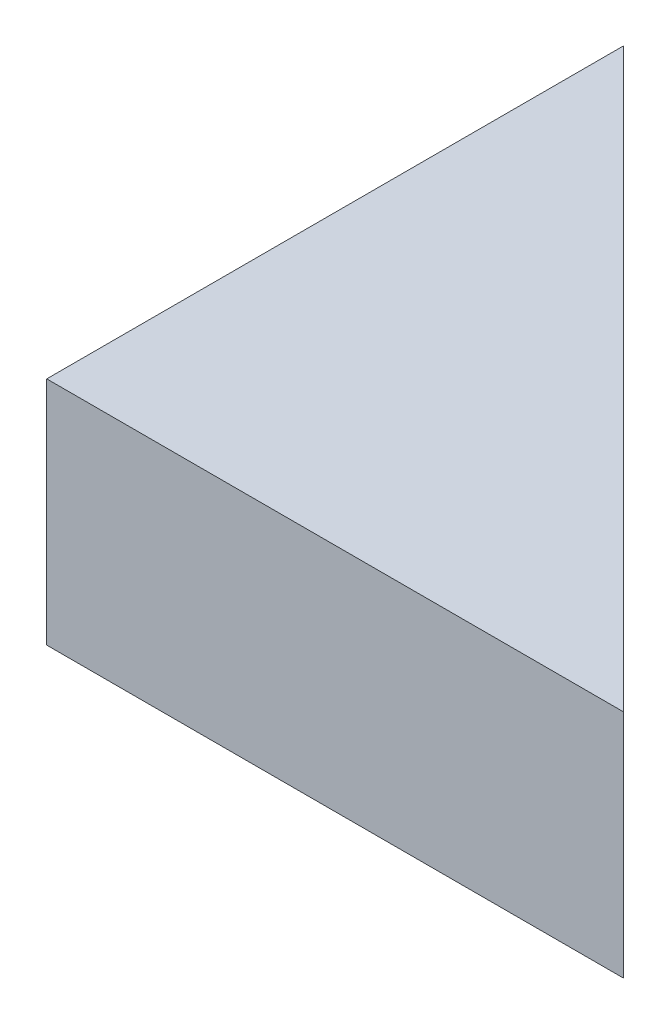
ISO-10303-21;
HEADER;
FILE_DESCRIPTION(('STEP AP214'),'2;1');
FILE_NAME('part.step','',(''),(''),'','','');
FILE_SCHEMA(('AUTOMOTIVE_DESIGN { 1 0 10303 214 1 1 1 1 }'));
ENDSEC;
DATA;
#1=APPLICATION_CONTEXT('core data for automotive mechanical design processes');
#2=APPLICATION_PROTOCOL_DEFINITION('international standard','automotive_design',2000,#1);
#3=PRODUCT_CONTEXT('',#1,'mechanical');
#4=PRODUCT('Part','Part','',(#3));
#5=PRODUCT_RELATED_PRODUCT_CATEGORY('part','',(#4));
#6=PRODUCT_DEFINITION_FORMATION('','',#4);
#7=PRODUCT_DEFINITION_CONTEXT('part definition',#1,'design');
#8=PRODUCT_DEFINITION('design','',#6,#7);
#9=PRODUCT_DEFINITION_SHAPE('','',#8);
#10=(LENGTH_UNIT() NAMED_UNIT(*) SI_UNIT(.MILLI.,.METRE.));
#11=(NAMED_UNIT(*) PLANE_ANGLE_UNIT() SI_UNIT($,.RADIAN.));
#12=(NAMED_UNIT(*) SI_UNIT($,.STERADIAN.) SOLID_ANGLE_UNIT());
#13=UNCERTAINTY_MEASURE_WITH_UNIT(LENGTH_MEASURE(1.E-05),#10,'distance_accuracy_value','');
#14=(GEOMETRIC_REPRESENTATION_CONTEXT(3) GLOBAL_UNCERTAINTY_ASSIGNED_CONTEXT((#13)) GLOBAL_UNIT_ASSIGNED_CONTEXT((#10,
#11,#12)) REPRESENTATION_CONTEXT('',''));
#15=CARTESIAN_POINT('',(0.,0.,0.));
#16=DIRECTION('',(0.,0.,1.));
#17=DIRECTION('',(1.,0.,0.));
#18=AXIS2_PLACEMENT_3D('',#15,#16,#17);
#19=CARTESIAN_POINT('',(500.,200.,0.));
#20=DIRECTION('',(0.,0.,-1.));
#21=DIRECTION('',(-1.,0.,0.));
#22=AXIS2_PLACEMENT_3D('',#19,#20,#21);
#23=PLANE('',#22);
#24=DIRECTION('',(1.,0.,0.));
#25=VECTOR('',#24,1.);
#26=CARTESIAN_POINT('',(500.,0.,0.));
#27=LINE('',#26,#25);
#28=CARTESIAN_POINT('',(0.,0.,0.));
#29=VERTEX_POINT('',#28);
#30=CARTESIAN_POINT('',(500.,0.,0.));
#31=VERTEX_POINT('',#30);
#32=EDGE_CURVE('E89',#29,#31,#27,.T.);
#33=ORIENTED_EDGE('',*,*,#32,.T.);
#34=DIRECTION('',(0.,-1.,0.));
#35=VECTOR('',#34,1.);
#36=CARTESIAN_POINT('',(500.,200.,0.));
#37=LINE('',#36,#35);
#38=CARTESIAN_POINT('',(500.,200.,0.));
#39=VERTEX_POINT('',#38);
#40=EDGE_CURVE('E11',#39,#31,#37,.T.);
#41=ORIENTED_EDGE('',*,*,#40,.F.);
#42=DIRECTION('',(1.,0.,0.));
#43=VECTOR('',#42,1.);
#44=CARTESIAN_POINT('',(500.,200.,0.));
#45=LINE('',#44,#43);
#46=CARTESIAN_POINT('',(0.,200.,0.));
#47=VERTEX_POINT('',#46);
#48=EDGE_CURVE('E81',#47,#39,#45,.T.);
#49=ORIENTED_EDGE('',*,*,#48,.F.);
#50=DIRECTION('',(0.,-1.,0.));
#51=VECTOR('',#50,1.);
#52=CARTESIAN_POINT('',(0.,200.,0.));
#53=LINE('',#52,#51);
#54=EDGE_CURVE('E90',#47,#29,#53,.T.);
#55=ORIENTED_EDGE('',*,*,#54,.T.);
#56=EDGE_LOOP('',(#33,#41,#49,#55));
#57=FACE_BOUND('',#56,.T.);
#58=ADVANCED_FACE('F39',(#57),#23,.F.);
#59=CARTESIAN_POINT('',(0.,200.,-500.));
#60=DIRECTION('',(-0.707106781186548,0.,0.707106781186547));
#61=DIRECTION('',(0.707106781186547,0.,0.707106781186548));
#62=AXIS2_PLACEMENT_3D('',#59,#60,#61);
#63=PLANE('',#62);
#64=DIRECTION('',(-0.707106781186547,0.,-0.707106781186548));
#65=VECTOR('',#64,1.);
#66=CARTESIAN_POINT('',(0.,0.,-500.));
#67=LINE('',#66,#65);
#68=CARTESIAN_POINT('',(0.,0.,-500.));
#69=VERTEX_POINT('',#68);
#70=EDGE_CURVE('E68',#31,#69,#67,.T.);
#71=ORIENTED_EDGE('',*,*,#70,.T.);
#72=DIRECTION('',(0.,-1.,0.));
#73=VECTOR('',#72,1.);
#74=CARTESIAN_POINT('',(0.,200.,-500.));
#75=LINE('',#74,#73);
#76=CARTESIAN_POINT('',(0.,200.,-500.));
#77=VERTEX_POINT('',#76);
#78=EDGE_CURVE('E48',#77,#69,#75,.T.);
#79=ORIENTED_EDGE('',*,*,#78,.F.);
#80=DIRECTION('',(-0.707106781186547,0.,-0.707106781186548));
#81=VECTOR('',#80,1.);
#82=CARTESIAN_POINT('',(0.,200.,-500.));
#83=LINE('',#82,#81);
#84=EDGE_CURVE('E76',#39,#77,#83,.T.);
#85=ORIENTED_EDGE('',*,*,#84,.F.);
#86=ORIENTED_EDGE('',*,*,#40,.T.);
#87=EDGE_LOOP('',(#71,#79,#85,#86));
#88=FACE_BOUND('',#87,.T.);
#89=ADVANCED_FACE('F77',(#88),#63,.F.);
#90=CARTESIAN_POINT('',(0.,200.,0.));
#91=DIRECTION('',(1.,0.,0.));
#92=DIRECTION('',(0.,0.,-1.));
#93=AXIS2_PLACEMENT_3D('',#90,#91,#92);
#94=PLANE('',#93);
#95=DIRECTION('',(0.,0.,1.));
#96=VECTOR('',#95,1.);
#97=CARTESIAN_POINT('',(0.,0.,0.));
#98=LINE('',#97,#96);
#99=EDGE_CURVE('E73',#69,#29,#98,.T.);
#100=ORIENTED_EDGE('',*,*,#99,.T.);
#101=ORIENTED_EDGE('',*,*,#54,.F.);
#102=DIRECTION('',(0.,0.,1.));
#103=VECTOR('',#102,1.);
#104=CARTESIAN_POINT('',(0.,200.,0.));
#105=LINE('',#104,#103);
#106=EDGE_CURVE('E56',#77,#47,#105,.T.);
#107=ORIENTED_EDGE('',*,*,#106,.F.);
#108=ORIENTED_EDGE('',*,*,#78,.T.);
#109=EDGE_LOOP('',(#100,#101,#107,#108));
#110=FACE_BOUND('',#109,.T.);
#111=ADVANCED_FACE('F102',(#110),#94,.F.);
#112=CARTESIAN_POINT('',(0.,200.,0.));
#113=DIRECTION('',(0.,-1.,0.));
#114=DIRECTION('',(0.,0.,-1.));
#115=AXIS2_PLACEMENT_3D('',#112,#113,#114);
#116=PLANE('',#115);
#117=ORIENTED_EDGE('',*,*,#48,.T.);
#118=ORIENTED_EDGE('',*,*,#84,.T.);
#119=ORIENTED_EDGE('',*,*,#106,.T.);
#120=EDGE_LOOP('',(#117,#118,#119));
#121=FACE_BOUND('',#120,.T.);
#122=ADVANCED_FACE('F84',(#121),#116,.F.);
#123=CARTESIAN_POINT('',(0.,0.,0.));
#124=DIRECTION('',(0.,-1.,0.));
#125=DIRECTION('',(0.,0.,-1.));
#126=AXIS2_PLACEMENT_3D('',#123,#124,#125);
#127=PLANE('',#126);
#128=ORIENTED_EDGE('',*,*,#32,.F.);
#129=ORIENTED_EDGE('',*,*,#99,.F.);
#130=ORIENTED_EDGE('',*,*,#70,.F.);
#131=EDGE_LOOP('',(#128,#129,#130));
#132=FACE_BOUND('',#131,.T.);
#133=ADVANCED_FACE('F103',(#132),#127,.T.);
#134=CLOSED_SHELL('',(#58,#89,#111,#122,#133));
#135=MANIFOLD_SOLID_BREP('B2',#134);
#136=ADVANCED_BREP_SHAPE_REPRESENTATION('',(#18,#135),#14);
#137=SHAPE_DEFINITION_REPRESENTATION(#9,#136);
ENDSEC;
END-ISO-10303-21;
